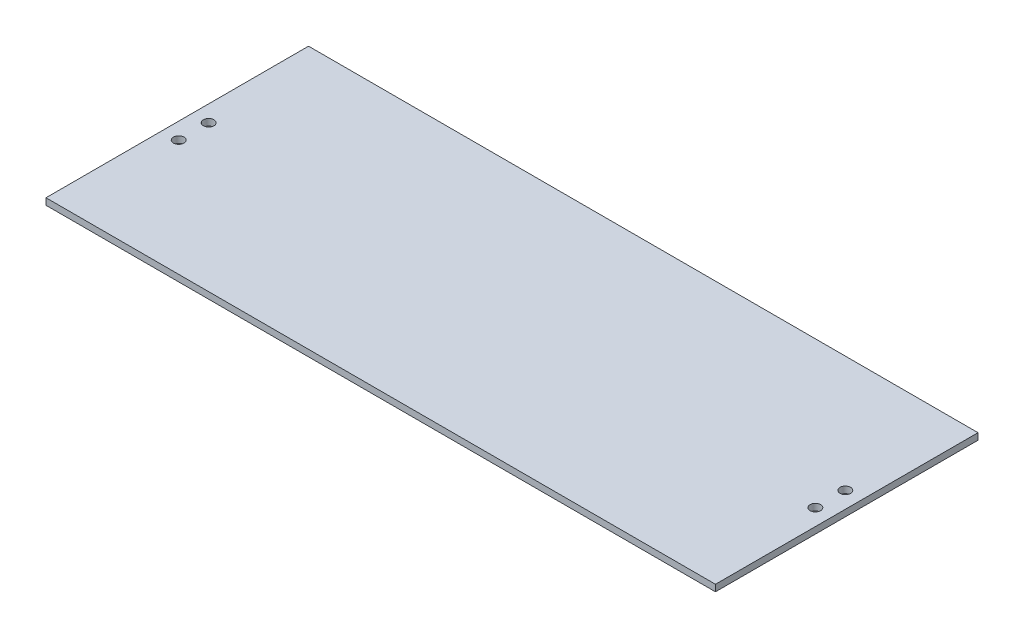
ISO-10303-21;
HEADER;
FILE_DESCRIPTION(('STEP AP214'),'2;1');
FILE_NAME('part.step','',(''),(''),'','','');
FILE_SCHEMA(('AUTOMOTIVE_DESIGN { 1 0 10303 214 1 1 1 1 }'));
ENDSEC;
DATA;
#1=APPLICATION_CONTEXT('core data for automotive mechanical design processes');
#2=APPLICATION_PROTOCOL_DEFINITION('international standard','automotive_design',2000,#1);
#3=PRODUCT_CONTEXT('',#1,'mechanical');
#4=PRODUCT('Part','Part','',(#3));
#5=PRODUCT_RELATED_PRODUCT_CATEGORY('part','',(#4));
#6=PRODUCT_DEFINITION_FORMATION('','',#4);
#7=PRODUCT_DEFINITION_CONTEXT('part definition',#1,'design');
#8=PRODUCT_DEFINITION('design','',#6,#7);
#9=PRODUCT_DEFINITION_SHAPE('','',#8);
#10=(LENGTH_UNIT() NAMED_UNIT(*) SI_UNIT(.MILLI.,.METRE.));
#11=(NAMED_UNIT(*) PLANE_ANGLE_UNIT() SI_UNIT($,.RADIAN.));
#12=(NAMED_UNIT(*) SI_UNIT($,.STERADIAN.) SOLID_ANGLE_UNIT());
#13=UNCERTAINTY_MEASURE_WITH_UNIT(LENGTH_MEASURE(1.E-05),#10,'distance_accuracy_value','');
#14=(GEOMETRIC_REPRESENTATION_CONTEXT(3) GLOBAL_UNCERTAINTY_ASSIGNED_CONTEXT((#13)) GLOBAL_UNIT_ASSIGNED_CONTEXT((#10,
#11,#12)) REPRESENTATION_CONTEXT('',''));
#15=CARTESIAN_POINT('',(0.,0.,0.));
#16=DIRECTION('',(0.,0.,1.));
#17=DIRECTION('',(1.,0.,0.));
#18=AXIS2_PLACEMENT_3D('',#15,#16,#17);
#19=CARTESIAN_POINT('',(0.,3.175,0.));
#20=DIRECTION('',(1.,0.,0.));
#21=DIRECTION('',(0.,0.,-1.));
#22=AXIS2_PLACEMENT_3D('',#19,#20,#21);
#23=PLANE('',#22);
#24=DIRECTION('',(0.,0.,1.));
#25=VECTOR('',#24,1.);
#26=CARTESIAN_POINT('',(0.,0.,0.));
#27=LINE('',#26,#25);
#28=CARTESIAN_POINT('',(0.,0.,-127.));
#29=VERTEX_POINT('',#28);
#30=CARTESIAN_POINT('',(0.,0.,0.));
#31=VERTEX_POINT('',#30);
#32=EDGE_CURVE('E96',#29,#31,#27,.T.);
#33=ORIENTED_EDGE('',*,*,#32,.T.);
#34=DIRECTION('',(0.,-1.,0.));
#35=VECTOR('',#34,1.);
#36=CARTESIAN_POINT('',(0.,3.175,0.));
#37=LINE('',#36,#35);
#38=CARTESIAN_POINT('',(0.,3.175,0.));
#39=VERTEX_POINT('',#38);
#40=EDGE_CURVE('E11',#39,#31,#37,.T.);
#41=ORIENTED_EDGE('',*,*,#40,.F.);
#42=DIRECTION('',(0.,0.,1.));
#43=VECTOR('',#42,1.);
#44=CARTESIAN_POINT('',(0.,3.175,0.));
#45=LINE('',#44,#43);
#46=CARTESIAN_POINT('',(0.,3.175,-127.));
#47=VERTEX_POINT('',#46);
#48=EDGE_CURVE('E84',#47,#39,#45,.T.);
#49=ORIENTED_EDGE('',*,*,#48,.F.);
#50=DIRECTION('',(0.,-1.,0.));
#51=VECTOR('',#50,1.);
#52=CARTESIAN_POINT('',(0.,3.175,-127.));
#53=LINE('',#52,#51);
#54=EDGE_CURVE('E92',#47,#29,#53,.T.);
#55=ORIENTED_EDGE('',*,*,#54,.T.);
#56=EDGE_LOOP('',(#33,#41,#49,#55));
#57=FACE_BOUND('',#56,.T.);
#58=ADVANCED_FACE('F33',(#57),#23,.F.);
#59=CARTESIAN_POINT('',(0.,3.175,0.));
#60=DIRECTION('',(0.,0.,-1.));
#61=DIRECTION('',(-1.,0.,0.));
#62=AXIS2_PLACEMENT_3D('',#59,#60,#61);
#63=PLANE('',#62);
#64=DIRECTION('',(1.,0.,0.));
#65=VECTOR('',#64,1.);
#66=CARTESIAN_POINT('',(0.,0.,0.));
#67=LINE('',#66,#65);
#68=CARTESIAN_POINT('',(323.85,0.,0.));
#69=VERTEX_POINT('',#68);
#70=EDGE_CURVE('E88',#31,#69,#67,.T.);
#71=ORIENTED_EDGE('',*,*,#70,.T.);
#72=DIRECTION('',(0.,-1.,0.));
#73=VECTOR('',#72,1.);
#74=CARTESIAN_POINT('',(323.85,3.175,0.));
#75=LINE('',#74,#73);
#76=CARTESIAN_POINT('',(323.85,3.175,0.));
#77=VERTEX_POINT('',#76);
#78=EDGE_CURVE('E41',#77,#69,#75,.T.);
#79=ORIENTED_EDGE('',*,*,#78,.F.);
#80=DIRECTION('',(1.,0.,0.));
#81=VECTOR('',#80,1.);
#82=CARTESIAN_POINT('',(0.,3.175,0.));
#83=LINE('',#82,#81);
#84=EDGE_CURVE('E79',#39,#77,#83,.T.);
#85=ORIENTED_EDGE('',*,*,#84,.F.);
#86=ORIENTED_EDGE('',*,*,#40,.T.);
#87=EDGE_LOOP('',(#71,#79,#85,#86));
#88=FACE_BOUND('',#87,.T.);
#89=ADVANCED_FACE('F87',(#88),#63,.F.);
#90=CARTESIAN_POINT('',(323.85,3.175,0.));
#91=DIRECTION('',(-1.,0.,0.));
#92=DIRECTION('',(0.,0.,1.));
#93=AXIS2_PLACEMENT_3D('',#90,#91,#92);
#94=PLANE('',#93);
#95=DIRECTION('',(0.,0.,-1.));
#96=VECTOR('',#95,1.);
#97=CARTESIAN_POINT('',(323.85,0.,0.));
#98=LINE('',#97,#96);
#99=CARTESIAN_POINT('',(323.85,0.,-127.));
#100=VERTEX_POINT('',#99);
#101=EDGE_CURVE('E66',#69,#100,#98,.T.);
#102=ORIENTED_EDGE('',*,*,#101,.T.);
#103=DIRECTION('',(0.,-1.,0.));
#104=VECTOR('',#103,1.);
#105=CARTESIAN_POINT('',(323.85,3.175,-127.));
#106=LINE('',#105,#104);
#107=CARTESIAN_POINT('',(323.85,3.175,-127.));
#108=VERTEX_POINT('',#107);
#109=EDGE_CURVE('E89',#108,#100,#106,.T.);
#110=ORIENTED_EDGE('',*,*,#109,.F.);
#111=DIRECTION('',(0.,0.,-1.));
#112=VECTOR('',#111,1.);
#113=CARTESIAN_POINT('',(323.85,3.175,0.));
#114=LINE('',#113,#112);
#115=EDGE_CURVE('E82',#77,#108,#114,.T.);
#116=ORIENTED_EDGE('',*,*,#115,.F.);
#117=ORIENTED_EDGE('',*,*,#78,.T.);
#118=EDGE_LOOP('',(#102,#110,#116,#117));
#119=FACE_BOUND('',#118,.T.);
#120=ADVANCED_FACE('F90',(#119),#94,.F.);
#121=CARTESIAN_POINT('',(0.,3.175,-127.));
#122=DIRECTION('',(0.,0.,1.));
#123=DIRECTION('',(1.,0.,0.));
#124=AXIS2_PLACEMENT_3D('',#121,#122,#123);
#125=PLANE('',#124);
#126=DIRECTION('',(-1.,0.,0.));
#127=VECTOR('',#126,1.);
#128=CARTESIAN_POINT('',(0.,0.,-127.));
#129=LINE('',#128,#127);
#130=EDGE_CURVE('E72',#100,#29,#129,.T.);
#131=ORIENTED_EDGE('',*,*,#130,.T.);
#132=ORIENTED_EDGE('',*,*,#54,.F.);
#133=DIRECTION('',(-1.,0.,0.));
#134=VECTOR('',#133,1.);
#135=CARTESIAN_POINT('',(0.,3.175,-127.));
#136=LINE('',#135,#134);
#137=EDGE_CURVE('E49',#108,#47,#136,.T.);
#138=ORIENTED_EDGE('',*,*,#137,.F.);
#139=ORIENTED_EDGE('',*,*,#109,.T.);
#140=EDGE_LOOP('',(#131,#132,#138,#139));
#141=FACE_BOUND('',#140,.T.);
#142=ADVANCED_FACE('F104',(#141),#125,.F.);
#143=CARTESIAN_POINT('',(0.,3.175,0.));
#144=DIRECTION('',(0.,-1.,0.));
#145=DIRECTION('',(0.,0.,-1.));
#146=AXIS2_PLACEMENT_3D('',#143,#144,#145);
#147=PLANE('',#146);
#148=CARTESIAN_POINT('',(315.9125,3.175,-56.25));
#149=DIRECTION('',(0.,-1.,0.));
#150=DIRECTION('',(0.,0.,-1.));
#151=AXIS2_PLACEMENT_3D('',#148,#149,#150);
#152=CIRCLE('',#151,2.55270000000002);
#153=CARTESIAN_POINT('',(315.9125,3.175,-58.8027));
#154=VERTEX_POINT('',#153);
#155=EDGE_CURVE('E127',#154,#154,#152,.T.);
#156=ORIENTED_EDGE('',*,*,#155,.T.);
#157=EDGE_LOOP('',(#156));
#158=FACE_BOUND('',#157,.T.);
#159=CARTESIAN_POINT('',(315.9125,3.175,-70.75));
#160=DIRECTION('',(0.,-1.,0.));
#161=DIRECTION('',(0.,0.,-1.));
#162=AXIS2_PLACEMENT_3D('',#159,#160,#161);
#163=CIRCLE('',#162,2.55270000000002);
#164=CARTESIAN_POINT('',(315.9125,3.175,-73.3027));
#165=VERTEX_POINT('',#164);
#166=EDGE_CURVE('E121',#165,#165,#163,.T.);
#167=ORIENTED_EDGE('',*,*,#166,.T.);
#168=EDGE_LOOP('',(#167));
#169=FACE_BOUND('',#168,.T.);
#170=CARTESIAN_POINT('',(7.93750000000004,3.175,-70.75));
#171=DIRECTION('',(0.,-1.,0.));
#172=DIRECTION('',(0.,0.,-1.));
#173=AXIS2_PLACEMENT_3D('',#170,#171,#172);
#174=CIRCLE('',#173,2.5527);
#175=CARTESIAN_POINT('',(7.93750000000004,3.175,-73.3027000000001));
#176=VERTEX_POINT('',#175);
#177=EDGE_CURVE('E115',#176,#176,#174,.T.);
#178=ORIENTED_EDGE('',*,*,#177,.T.);
#179=EDGE_LOOP('',(#178));
#180=FACE_BOUND('',#179,.T.);
#181=CARTESIAN_POINT('',(7.93750000000004,3.175,-56.25));
#182=DIRECTION('',(0.,-1.,0.));
#183=DIRECTION('',(0.,0.,-1.));
#184=AXIS2_PLACEMENT_3D('',#181,#182,#183);
#185=CIRCLE('',#184,2.5527);
#186=CARTESIAN_POINT('',(7.93750000000004,3.175,-58.8027000000001));
#187=VERTEX_POINT('',#186);
#188=EDGE_CURVE('E99',#187,#187,#185,.T.);
#189=ORIENTED_EDGE('',*,*,#188,.T.);
#190=EDGE_LOOP('',(#189));
#191=FACE_BOUND('',#190,.T.);
#192=ORIENTED_EDGE('',*,*,#48,.T.);
#193=ORIENTED_EDGE('',*,*,#84,.T.);
#194=ORIENTED_EDGE('',*,*,#115,.T.);
#195=ORIENTED_EDGE('',*,*,#137,.T.);
#196=EDGE_LOOP('',(#192,#193,#194,#195));
#197=FACE_BOUND('',#196,.T.);
#198=ADVANCED_FACE('F80',(#158,#169,#180,#191,#197),#147,.F.);
#199=CARTESIAN_POINT('',(0.,0.,0.));
#200=DIRECTION('',(0.,-1.,0.));
#201=DIRECTION('',(0.,0.,-1.));
#202=AXIS2_PLACEMENT_3D('',#199,#200,#201);
#203=PLANE('',#202);
#204=CARTESIAN_POINT('',(315.9125,0.,-56.25));
#205=DIRECTION('',(0.,-1.,0.));
#206=DIRECTION('',(0.,0.,-1.));
#207=AXIS2_PLACEMENT_3D('',#204,#205,#206);
#208=CIRCLE('',#207,2.55269999999996);
#209=CARTESIAN_POINT('',(315.9125,0.,-58.8027));
#210=VERTEX_POINT('',#209);
#211=EDGE_CURVE('E130',#210,#210,#208,.T.);
#212=ORIENTED_EDGE('',*,*,#211,.F.);
#213=EDGE_LOOP('',(#212));
#214=FACE_BOUND('',#213,.T.);
#215=CARTESIAN_POINT('',(315.9125,0.,-70.75));
#216=DIRECTION('',(0.,-1.,0.));
#217=DIRECTION('',(0.,0.,-1.));
#218=AXIS2_PLACEMENT_3D('',#215,#216,#217);
#219=CIRCLE('',#218,2.55269999999996);
#220=CARTESIAN_POINT('',(315.9125,0.,-73.3027));
#221=VERTEX_POINT('',#220);
#222=EDGE_CURVE('E124',#221,#221,#219,.T.);
#223=ORIENTED_EDGE('',*,*,#222,.F.);
#224=EDGE_LOOP('',(#223));
#225=FACE_BOUND('',#224,.T.);
#226=CARTESIAN_POINT('',(7.93750000000004,0.,-70.75));
#227=DIRECTION('',(0.,-1.,0.));
#228=DIRECTION('',(0.,0.,-1.));
#229=AXIS2_PLACEMENT_3D('',#226,#227,#228);
#230=CIRCLE('',#229,2.55269999999999);
#231=CARTESIAN_POINT('',(7.93750000000004,0.,-73.3027));
#232=VERTEX_POINT('',#231);
#233=EDGE_CURVE('E118',#232,#232,#230,.T.);
#234=ORIENTED_EDGE('',*,*,#233,.F.);
#235=EDGE_LOOP('',(#234));
#236=FACE_BOUND('',#235,.T.);
#237=CARTESIAN_POINT('',(7.93750000000004,0.,-56.25));
#238=DIRECTION('',(0.,-1.,0.));
#239=DIRECTION('',(0.,0.,-1.));
#240=AXIS2_PLACEMENT_3D('',#237,#238,#239);
#241=CIRCLE('',#240,2.55269999999999);
#242=CARTESIAN_POINT('',(7.93750000000004,0.,-58.8027));
#243=VERTEX_POINT('',#242);
#244=EDGE_CURVE('E112',#243,#243,#241,.T.);
#245=ORIENTED_EDGE('',*,*,#244,.F.);
#246=EDGE_LOOP('',(#245));
#247=FACE_BOUND('',#246,.T.);
#248=ORIENTED_EDGE('',*,*,#32,.F.);
#249=ORIENTED_EDGE('',*,*,#130,.F.);
#250=ORIENTED_EDGE('',*,*,#101,.F.);
#251=ORIENTED_EDGE('',*,*,#70,.F.);
#252=EDGE_LOOP('',(#248,#249,#250,#251));
#253=FACE_BOUND('',#252,.T.);
#254=ADVANCED_FACE('F107',(#214,#225,#236,#247,#253),#203,.T.);
#255=CARTESIAN_POINT('',(7.93750000000004,0.,-56.25));
#256=DIRECTION('',(0.,-1.,0.));
#257=DIRECTION('',(0.,0.,-1.));
#258=AXIS2_PLACEMENT_3D('',#255,#256,#257);
#259=CYLINDRICAL_SURFACE('',#258,2.55269999999999);
#260=ORIENTED_EDGE('',*,*,#188,.F.);
#261=EDGE_LOOP('',(#260));
#262=FACE_BOUND('',#261,.T.);
#263=ORIENTED_EDGE('',*,*,#244,.T.);
#264=EDGE_LOOP('',(#263));
#265=FACE_BOUND('',#264,.T.);
#266=ADVANCED_FACE('F138',(#262,#265),#259,.F.);
#267=CARTESIAN_POINT('',(7.93750000000004,0.,-70.75));
#268=DIRECTION('',(0.,-1.,0.));
#269=DIRECTION('',(0.,0.,-1.));
#270=AXIS2_PLACEMENT_3D('',#267,#268,#269);
#271=CYLINDRICAL_SURFACE('',#270,2.55269999999999);
#272=ORIENTED_EDGE('',*,*,#177,.F.);
#273=EDGE_LOOP('',(#272));
#274=FACE_BOUND('',#273,.T.);
#275=ORIENTED_EDGE('',*,*,#233,.T.);
#276=EDGE_LOOP('',(#275));
#277=FACE_BOUND('',#276,.T.);
#278=ADVANCED_FACE('F147',(#274,#277),#271,.F.);
#279=CARTESIAN_POINT('',(315.9125,0.,-70.75));
#280=DIRECTION('',(0.,-1.,0.));
#281=DIRECTION('',(0.,0.,-1.));
#282=AXIS2_PLACEMENT_3D('',#279,#280,#281);
#283=CYLINDRICAL_SURFACE('',#282,2.55269999999999);
#284=ORIENTED_EDGE('',*,*,#166,.F.);
#285=EDGE_LOOP('',(#284));
#286=FACE_BOUND('',#285,.T.);
#287=ORIENTED_EDGE('',*,*,#222,.T.);
#288=EDGE_LOOP('',(#287));
#289=FACE_BOUND('',#288,.T.);
#290=ADVANCED_FACE('F154',(#286,#289),#283,.F.);
#291=CARTESIAN_POINT('',(315.9125,0.,-56.25));
#292=DIRECTION('',(0.,-1.,0.));
#293=DIRECTION('',(0.,0.,-1.));
#294=AXIS2_PLACEMENT_3D('',#291,#292,#293);
#295=CYLINDRICAL_SURFACE('',#294,2.55269999999999);
#296=ORIENTED_EDGE('',*,*,#155,.F.);
#297=EDGE_LOOP('',(#296));
#298=FACE_BOUND('',#297,.T.);
#299=ORIENTED_EDGE('',*,*,#211,.T.);
#300=EDGE_LOOP('',(#299));
#301=FACE_BOUND('',#300,.T.);
#302=ADVANCED_FACE('F134',(#298,#301),#295,.F.);
#303=CLOSED_SHELL('',(#58,#89,#120,#142,#198,#254,#266,#278,#290,#302));
#304=MANIFOLD_SOLID_BREP('B2',#303);
#305=ADVANCED_BREP_SHAPE_REPRESENTATION('',(#18,#304),#14);
#306=SHAPE_DEFINITION_REPRESENTATION(#9,#305);
ENDSEC;
END-ISO-10303-21;
